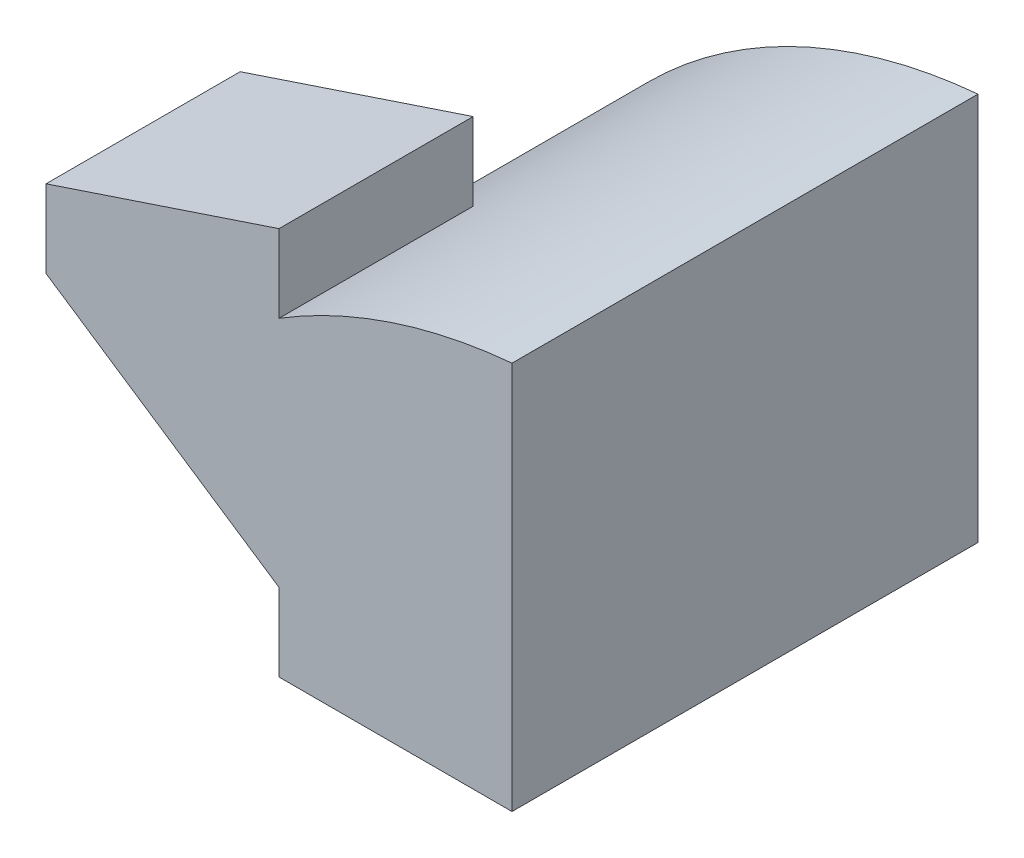
ISO-10303-21;
HEADER;
FILE_DESCRIPTION(('STEP AP214'),'2;1');
FILE_NAME('part.step','',(''),(''),'','','');
FILE_SCHEMA(('AUTOMOTIVE_DESIGN { 1 0 10303 214 1 1 1 1 }'));
ENDSEC;
DATA;
#1=APPLICATION_CONTEXT('core data for automotive mechanical design processes');
#2=APPLICATION_PROTOCOL_DEFINITION('international standard','automotive_design',2000,#1);
#3=PRODUCT_CONTEXT('',#1,'mechanical');
#4=PRODUCT('Part','Part','',(#3));
#5=PRODUCT_RELATED_PRODUCT_CATEGORY('part','',(#4));
#6=PRODUCT_DEFINITION_FORMATION('','',#4);
#7=PRODUCT_DEFINITION_CONTEXT('part definition',#1,'design');
#8=PRODUCT_DEFINITION('design','',#6,#7);
#9=PRODUCT_DEFINITION_SHAPE('','',#8);
#10=(LENGTH_UNIT() NAMED_UNIT(*) SI_UNIT(.MILLI.,.METRE.));
#11=(NAMED_UNIT(*) PLANE_ANGLE_UNIT() SI_UNIT($,.RADIAN.));
#12=(NAMED_UNIT(*) SI_UNIT($,.STERADIAN.) SOLID_ANGLE_UNIT());
#13=UNCERTAINTY_MEASURE_WITH_UNIT(LENGTH_MEASURE(1.E-05),#10,'distance_accuracy_value','');
#14=(GEOMETRIC_REPRESENTATION_CONTEXT(3) GLOBAL_UNCERTAINTY_ASSIGNED_CONTEXT((#13)) GLOBAL_UNIT_ASSIGNED_CONTEXT((#10,
#11,#12)) REPRESENTATION_CONTEXT('',''));
#15=CARTESIAN_POINT('',(0.,0.,0.));
#16=DIRECTION('',(0.,0.,1.));
#17=DIRECTION('',(1.,0.,0.));
#18=AXIS2_PLACEMENT_3D('',#15,#16,#17);
#19=CARTESIAN_POINT('',(-3.,5.,3.));
#20=DIRECTION('',(1.,0.,0.));
#21=DIRECTION('',(0.,0.,-1.));
#22=AXIS2_PLACEMENT_3D('',#19,#20,#21);
#23=PLANE('',#22);
#24=DIRECTION('',(0.,0.,1.));
#25=VECTOR('',#24,1.);
#26=CARTESIAN_POINT('',(-3.,4.,-0.5));
#27=LINE('',#26,#25);
#28=CARTESIAN_POINT('',(-3.,4.,0.5));
#29=VERTEX_POINT('',#28);
#30=CARTESIAN_POINT('',(-3.,4.,3.));
#31=VERTEX_POINT('',#30);
#32=EDGE_CURVE('E109',#29,#31,#27,.T.);
#33=ORIENTED_EDGE('',*,*,#32,.F.);
#34=DIRECTION('',(0.,1.,0.));
#35=VECTOR('',#34,1.);
#36=CARTESIAN_POINT('',(-3.,0.,0.5));
#37=LINE('',#36,#35);
#38=CARTESIAN_POINT('',(-3.,3.,0.5));
#39=VERTEX_POINT('',#38);
#40=EDGE_CURVE('E143',#39,#29,#37,.T.);
#41=ORIENTED_EDGE('',*,*,#40,.F.);
#42=DIRECTION('',(0.,0.,1.));
#43=VECTOR('',#42,1.);
#44=CARTESIAN_POINT('',(-3.,3.,-0.5));
#45=LINE('',#44,#43);
#46=CARTESIAN_POINT('',(-3.,3.,3.));
#47=VERTEX_POINT('',#46);
#48=EDGE_CURVE('E48',#39,#47,#45,.T.);
#49=ORIENTED_EDGE('',*,*,#48,.T.);
#50=DIRECTION('',(0.,-1.,0.));
#51=VECTOR('',#50,1.);
#52=CARTESIAN_POINT('',(-3.,5.,3.));
#53=LINE('',#52,#51);
#54=EDGE_CURVE('E126',#31,#47,#53,.T.);
#55=ORIENTED_EDGE('',*,*,#54,.F.);
#56=EDGE_LOOP('',(#33,#41,#49,#55));
#57=FACE_BOUND('',#56,.T.);
#58=ADVANCED_FACE('F33',(#57),#23,.F.);
#59=CARTESIAN_POINT('',(-3.,5.,3.));
#60=DIRECTION('',(0.,0.,-1.));
#61=DIRECTION('',(-1.,0.,0.));
#62=AXIS2_PLACEMENT_3D('',#59,#60,#61);
#63=PLANE('',#62);
#64=DIRECTION('',(-0.948683298050514,-0.316227766016838,0.));
#65=VECTOR('',#64,1.);
#66=CARTESIAN_POINT('',(-1.5,4.5,3.));
#67=LINE('',#66,#65);
#68=CARTESIAN_POINT('',(0.,5.,3.));
#69=VERTEX_POINT('',#68);
#70=EDGE_CURVE('E112',#69,#31,#67,.T.);
#71=ORIENTED_EDGE('',*,*,#70,.T.);
#72=ORIENTED_EDGE('',*,*,#54,.T.);
#73=DIRECTION('',(0.832050294337844,-0.554700196225229,0.));
#74=VECTOR('',#73,1.);
#75=CARTESIAN_POINT('',(0.461538461538461,0.692307692307692,3.));
#76=LINE('',#75,#74);
#77=CARTESIAN_POINT('',(0.,1.,3.));
#78=VERTEX_POINT('',#77);
#79=EDGE_CURVE('E199',#47,#78,#76,.T.);
#80=ORIENTED_EDGE('',*,*,#79,.T.);
#81=DIRECTION('',(0.,-1.,0.));
#82=VECTOR('',#81,1.);
#83=CARTESIAN_POINT('',(0.,0.,3.));
#84=LINE('',#83,#82);
#85=CARTESIAN_POINT('',(0.,0.,3.));
#86=VERTEX_POINT('',#85);
#87=EDGE_CURVE('E169',#78,#86,#84,.T.);
#88=ORIENTED_EDGE('',*,*,#87,.T.);
#89=DIRECTION('',(1.,0.,0.));
#90=VECTOR('',#89,1.);
#91=CARTESIAN_POINT('',(-3.,0.,3.));
#92=LINE('',#91,#90);
#93=CARTESIAN_POINT('',(3.,0.,3.));
#94=VERTEX_POINT('',#93);
#95=EDGE_CURVE('E158',#86,#94,#92,.T.);
#96=ORIENTED_EDGE('',*,*,#95,.T.);
#97=DIRECTION('',(0.,-1.,0.));
#98=VECTOR('',#97,1.);
#99=CARTESIAN_POINT('',(3.,5.,3.));
#100=LINE('',#99,#98);
#101=CARTESIAN_POINT('',(3.,5.,3.));
#102=VERTEX_POINT('',#101);
#103=EDGE_CURVE('E132',#102,#94,#100,.T.);
#104=ORIENTED_EDGE('',*,*,#103,.F.);
#105=CARTESIAN_POINT('',(3.61111111111111,-1.83333333333333,3.));
#106=DIRECTION('',(0.,0.,-1.));
#107=DIRECTION('',(-1.,0.,0.));
#108=AXIS2_PLACEMENT_3D('',#105,#106,#107);
#109=CIRCLE('',#108,6.86060501957137);
#110=CARTESIAN_POINT('',(0.,4.,3.));
#111=VERTEX_POINT('',#110);
#112=EDGE_CURVE('E157',#102,#111,#109,.F.);
#113=ORIENTED_EDGE('',*,*,#112,.T.);
#114=DIRECTION('',(0.,1.,0.));
#115=VECTOR('',#114,1.);
#116=CARTESIAN_POINT('',(0.,5.,3.));
#117=LINE('',#116,#115);
#118=EDGE_CURVE('E128',#111,#69,#117,.T.);
#119=ORIENTED_EDGE('',*,*,#118,.T.);
#120=EDGE_LOOP('',(#71,#72,#80,#88,#96,#104,#113,#119));
#121=FACE_BOUND('',#120,.T.);
#122=ADVANCED_FACE('F124',(#121),#63,.F.);
#123=CARTESIAN_POINT('',(0.,0.,0.));
#124=DIRECTION('',(0.,-1.,0.));
#125=DIRECTION('',(0.,0.,-1.));
#126=AXIS2_PLACEMENT_3D('',#123,#124,#125);
#127=PLANE('',#126);
#128=ORIENTED_EDGE('',*,*,#95,.F.);
#129=DIRECTION('',(0.,0.,1.));
#130=VECTOR('',#129,1.);
#131=CARTESIAN_POINT('',(0.,0.,-0.5));
#132=LINE('',#131,#130);
#133=CARTESIAN_POINT('',(0.,0.,-0.5));
#134=VERTEX_POINT('',#133);
#135=EDGE_CURVE('E129',#134,#86,#132,.T.);
#136=ORIENTED_EDGE('',*,*,#135,.F.);
#137=DIRECTION('',(1.,0.,0.));
#138=VECTOR('',#137,1.);
#139=CARTESIAN_POINT('',(0.,0.,-0.5));
#140=LINE('',#139,#138);
#141=CARTESIAN_POINT('',(-3.,0.,-0.5));
#142=VERTEX_POINT('',#141);
#143=EDGE_CURVE('E196',#142,#134,#140,.T.);
#144=ORIENTED_EDGE('',*,*,#143,.F.);
#145=DIRECTION('',(0.,0.,1.));
#146=VECTOR('',#145,1.);
#147=CARTESIAN_POINT('',(-3.,0.,3.));
#148=LINE('',#147,#146);
#149=CARTESIAN_POINT('',(-3.,0.,-3.));
#150=VERTEX_POINT('',#149);
#151=EDGE_CURVE('E162',#150,#142,#148,.T.);
#152=ORIENTED_EDGE('',*,*,#151,.F.);
#153=DIRECTION('',(-1.,0.,0.));
#154=VECTOR('',#153,1.);
#155=CARTESIAN_POINT('',(-3.,0.,-3.));
#156=LINE('',#155,#154);
#157=CARTESIAN_POINT('',(3.,0.,-3.));
#158=VERTEX_POINT('',#157);
#159=EDGE_CURVE('E150',#158,#150,#156,.T.);
#160=ORIENTED_EDGE('',*,*,#159,.F.);
#161=DIRECTION('',(0.,0.,-1.));
#162=VECTOR('',#161,1.);
#163=CARTESIAN_POINT('',(3.,0.,3.));
#164=LINE('',#163,#162);
#165=EDGE_CURVE('E147',#94,#158,#164,.T.);
#166=ORIENTED_EDGE('',*,*,#165,.F.);
#167=EDGE_LOOP('',(#128,#136,#144,#152,#160,#166));
#168=FACE_BOUND('',#167,.T.);
#169=ADVANCED_FACE('F175',(#168),#127,.T.);
#170=CARTESIAN_POINT('',(3.61111111111111,-1.83333333333333,0.5));
#171=DIRECTION('',(0.,0.,-1.));
#172=DIRECTION('',(-1.,0.,0.));
#173=AXIS2_PLACEMENT_3D('',#170,#171,#172);
#174=CYLINDRICAL_SURFACE('',#173,6.86060501957137);
#175=DIRECTION('',(0.,0.,-1.));
#176=VECTOR('',#175,1.);
#177=CARTESIAN_POINT('',(-1.89305507401644,2.26203671601096,0.5));
#178=LINE('',#177,#176);
#179=CARTESIAN_POINT('',(-1.89305507401644,2.26203671601096,0.5));
#180=VERTEX_POINT('',#179);
#181=CARTESIAN_POINT('',(-1.89305507401644,2.26203671601096,-0.5));
#182=VERTEX_POINT('',#181);
#183=EDGE_CURVE('E191',#180,#182,#178,.T.);
#184=ORIENTED_EDGE('',*,*,#183,.F.);
#185=CARTESIAN_POINT('',(3.61111111111111,-1.83333333333333,0.5));
#186=DIRECTION('',(0.,0.,-1.));
#187=DIRECTION('',(-1.,0.,0.));
#188=AXIS2_PLACEMENT_3D('',#185,#186,#187);
#189=CIRCLE('',#188,6.86060501957137);
#190=CARTESIAN_POINT('',(0.,4.,0.5));
#191=VERTEX_POINT('',#190);
#192=EDGE_CURVE('E145',#191,#180,#189,.F.);
#193=ORIENTED_EDGE('',*,*,#192,.F.);
#194=DIRECTION('',(0.,0.,-1.));
#195=VECTOR('',#194,1.);
#196=CARTESIAN_POINT('',(0.,4.,4.));
#197=LINE('',#196,#195);
#198=EDGE_CURVE('E56',#111,#191,#197,.T.);
#199=ORIENTED_EDGE('',*,*,#198,.F.);
#200=ORIENTED_EDGE('',*,*,#112,.F.);
#201=DIRECTION('',(0.,0.,-1.));
#202=VECTOR('',#201,1.);
#203=CARTESIAN_POINT('',(3.,5.,3.));
#204=LINE('',#203,#202);
#205=CARTESIAN_POINT('',(3.,5.,-3.));
#206=VERTEX_POINT('',#205);
#207=EDGE_CURVE('E137',#102,#206,#204,.T.);
#208=ORIENTED_EDGE('',*,*,#207,.T.);
#209=CARTESIAN_POINT('',(3.61111111111111,-1.83333333333333,-3.));
#210=DIRECTION('',(0.,0.,-1.));
#211=DIRECTION('',(-1.,0.,0.));
#212=AXIS2_PLACEMENT_3D('',#209,#210,#211);
#213=CIRCLE('',#212,6.86060501957137);
#214=EDGE_CURVE('E152',#206,#150,#213,.F.);
#215=ORIENTED_EDGE('',*,*,#214,.T.);
#216=ORIENTED_EDGE('',*,*,#151,.T.);
#217=CARTESIAN_POINT('',(3.61111111111111,-1.83333333333333,-0.5));
#218=DIRECTION('',(0.,0.,1.));
#219=DIRECTION('',(1.,0.,0.));
#220=AXIS2_PLACEMENT_3D('',#217,#218,#219);
#221=CIRCLE('',#220,6.86060501957137);
#222=EDGE_CURVE('E11',#182,#142,#221,.T.);
#223=ORIENTED_EDGE('',*,*,#222,.F.);
#224=EDGE_LOOP('',(#184,#193,#199,#200,#208,#215,#216,#223));
#225=FACE_BOUND('',#224,.T.);
#226=ADVANCED_FACE('F182',(#225),#174,.T.);
#227=CARTESIAN_POINT('',(0.,0.,0.5));
#228=DIRECTION('',(0.,0.,-1.));
#229=DIRECTION('',(-1.,0.,0.));
#230=AXIS2_PLACEMENT_3D('',#227,#228,#229);
#231=PLANE('',#230);
#232=ORIENTED_EDGE('',*,*,#40,.T.);
#233=DIRECTION('',(0.948683298050514,0.316227766016838,0.));
#234=VECTOR('',#233,1.);
#235=CARTESIAN_POINT('',(-1.5,4.5,0.5));
#236=LINE('',#235,#234);
#237=CARTESIAN_POINT('',(0.,5.,0.5));
#238=VERTEX_POINT('',#237);
#239=EDGE_CURVE('E115',#29,#238,#236,.T.);
#240=ORIENTED_EDGE('',*,*,#239,.T.);
#241=DIRECTION('',(0.,1.,0.));
#242=VECTOR('',#241,1.);
#243=CARTESIAN_POINT('',(0.,0.,0.5));
#244=LINE('',#243,#242);
#245=EDGE_CURVE('E188',#191,#238,#244,.T.);
#246=ORIENTED_EDGE('',*,*,#245,.F.);
#247=ORIENTED_EDGE('',*,*,#192,.T.);
#248=DIRECTION('',(-0.832050294337844,0.554700196225229,0.));
#249=VECTOR('',#248,1.);
#250=CARTESIAN_POINT('',(0.461538461538461,0.692307692307692,0.5));
#251=LINE('',#250,#249);
#252=EDGE_CURVE('E41',#180,#39,#251,.T.);
#253=ORIENTED_EDGE('',*,*,#252,.T.);
#254=EDGE_LOOP('',(#232,#240,#246,#247,#253));
#255=FACE_BOUND('',#254,.T.);
#256=ADVANCED_FACE('F142',(#255),#231,.T.);
#257=CARTESIAN_POINT('',(-3.,5.,-3.));
#258=DIRECTION('',(0.,0.,1.));
#259=DIRECTION('',(1.,0.,0.));
#260=AXIS2_PLACEMENT_3D('',#257,#258,#259);
#261=PLANE('',#260);
#262=ORIENTED_EDGE('',*,*,#159,.T.);
#263=ORIENTED_EDGE('',*,*,#214,.F.);
#264=DIRECTION('',(0.,-1.,0.));
#265=VECTOR('',#264,1.);
#266=CARTESIAN_POINT('',(3.,5.,-3.));
#267=LINE('',#266,#265);
#268=EDGE_CURVE('E131',#206,#158,#267,.T.);
#269=ORIENTED_EDGE('',*,*,#268,.T.);
#270=EDGE_LOOP('',(#262,#263,#269));
#271=FACE_BOUND('',#270,.T.);
#272=ADVANCED_FACE('F180',(#271),#261,.F.);
#273=CARTESIAN_POINT('',(3.,5.,3.));
#274=DIRECTION('',(-1.,0.,0.));
#275=DIRECTION('',(0.,0.,1.));
#276=AXIS2_PLACEMENT_3D('',#273,#274,#275);
#277=PLANE('',#276);
#278=ORIENTED_EDGE('',*,*,#165,.T.);
#279=ORIENTED_EDGE('',*,*,#268,.F.);
#280=ORIENTED_EDGE('',*,*,#207,.F.);
#281=ORIENTED_EDGE('',*,*,#103,.T.);
#282=EDGE_LOOP('',(#278,#279,#280,#281));
#283=FACE_BOUND('',#282,.T.);
#284=ADVANCED_FACE('F35',(#283),#277,.F.);
#285=CARTESIAN_POINT('',(0.,0.,4.));
#286=DIRECTION('',(-1.,0.,0.));
#287=DIRECTION('',(0.,-1.,0.));
#288=AXIS2_PLACEMENT_3D('',#285,#286,#287);
#289=PLANE('',#288);
#290=ORIENTED_EDGE('',*,*,#198,.T.);
#291=ORIENTED_EDGE('',*,*,#245,.T.);
#292=DIRECTION('',(0.,0.,-1.));
#293=VECTOR('',#292,1.);
#294=CARTESIAN_POINT('',(0.,5.,4.));
#295=LINE('',#294,#293);
#296=EDGE_CURVE('E184',#69,#238,#295,.T.);
#297=ORIENTED_EDGE('',*,*,#296,.F.);
#298=ORIENTED_EDGE('',*,*,#118,.F.);
#299=EDGE_LOOP('',(#290,#291,#297,#298));
#300=FACE_BOUND('',#299,.T.);
#301=ADVANCED_FACE('F235',(#300),#289,.F.);
#302=CARTESIAN_POINT('',(-1.5,4.5,-0.5));
#303=DIRECTION('',(-0.316227766016838,0.948683298050514,0.));
#304=DIRECTION('',(-0.948683298050514,-0.316227766016838,0.));
#305=AXIS2_PLACEMENT_3D('',#302,#303,#304);
#306=PLANE('',#305);
#307=ORIENTED_EDGE('',*,*,#32,.T.);
#308=ORIENTED_EDGE('',*,*,#70,.F.);
#309=ORIENTED_EDGE('',*,*,#296,.T.);
#310=ORIENTED_EDGE('',*,*,#239,.F.);
#311=EDGE_LOOP('',(#307,#308,#309,#310));
#312=FACE_BOUND('',#311,.T.);
#313=ADVANCED_FACE('F111',(#312),#306,.T.);
#314=CARTESIAN_POINT('',(0.,0.,-0.5));
#315=DIRECTION('',(0.,0.,1.));
#316=DIRECTION('',(1.,0.,0.));
#317=AXIS2_PLACEMENT_3D('',#314,#315,#316);
#318=PLANE('',#317);
#319=ORIENTED_EDGE('',*,*,#222,.T.);
#320=ORIENTED_EDGE('',*,*,#143,.T.);
#321=DIRECTION('',(0.,-1.,0.));
#322=VECTOR('',#321,1.);
#323=CARTESIAN_POINT('',(0.,0.,-0.5));
#324=LINE('',#323,#322);
#325=CARTESIAN_POINT('',(0.,1.,-0.5));
#326=VERTEX_POINT('',#325);
#327=EDGE_CURVE('E201',#326,#134,#324,.T.);
#328=ORIENTED_EDGE('',*,*,#327,.F.);
#329=DIRECTION('',(0.832050294337844,-0.554700196225229,0.));
#330=VECTOR('',#329,1.);
#331=CARTESIAN_POINT('',(0.461538461538461,0.692307692307692,-0.5));
#332=LINE('',#331,#330);
#333=EDGE_CURVE('E205',#182,#326,#332,.T.);
#334=ORIENTED_EDGE('',*,*,#333,.F.);
#335=EDGE_LOOP('',(#319,#320,#328,#334));
#336=FACE_BOUND('',#335,.T.);
#337=ADVANCED_FACE('F213',(#336),#318,.T.);
#338=CARTESIAN_POINT('',(0.461538461538461,0.692307692307692,-0.5));
#339=DIRECTION('',(-0.554700196225229,-0.832050294337844,0.));
#340=DIRECTION('',(0.832050294337844,-0.554700196225229,0.));
#341=AXIS2_PLACEMENT_3D('',#338,#339,#340);
#342=PLANE('',#341);
#343=ORIENTED_EDGE('',*,*,#183,.T.);
#344=ORIENTED_EDGE('',*,*,#333,.T.);
#345=DIRECTION('',(0.,0.,1.));
#346=VECTOR('',#345,1.);
#347=CARTESIAN_POINT('',(0.,1.,-0.5));
#348=LINE('',#347,#346);
#349=EDGE_CURVE('E194',#326,#78,#348,.T.);
#350=ORIENTED_EDGE('',*,*,#349,.T.);
#351=ORIENTED_EDGE('',*,*,#79,.F.);
#352=ORIENTED_EDGE('',*,*,#48,.F.);
#353=ORIENTED_EDGE('',*,*,#252,.F.);
#354=EDGE_LOOP('',(#343,#344,#350,#351,#352,#353));
#355=FACE_BOUND('',#354,.T.);
#356=ADVANCED_FACE('F214',(#355),#342,.T.);
#357=CARTESIAN_POINT('',(0.,0.,-0.5));
#358=DIRECTION('',(-1.,0.,0.));
#359=DIRECTION('',(0.,-1.,0.));
#360=AXIS2_PLACEMENT_3D('',#357,#358,#359);
#361=PLANE('',#360);
#362=ORIENTED_EDGE('',*,*,#87,.F.);
#363=ORIENTED_EDGE('',*,*,#349,.F.);
#364=ORIENTED_EDGE('',*,*,#327,.T.);
#365=ORIENTED_EDGE('',*,*,#135,.T.);
#366=EDGE_LOOP('',(#362,#363,#364,#365));
#367=FACE_BOUND('',#366,.T.);
#368=ADVANCED_FACE('F210',(#367),#361,.T.);
#369=CLOSED_SHELL('',(#58,#122,#169,#226,#256,#272,#284,#301,#313,#337,#356,#368));
#370=MANIFOLD_SOLID_BREP('B2',#369);
#371=ADVANCED_BREP_SHAPE_REPRESENTATION('',(#18,#370),#14);
#372=SHAPE_DEFINITION_REPRESENTATION(#9,#371);
ENDSEC;
END-ISO-10303-21;
